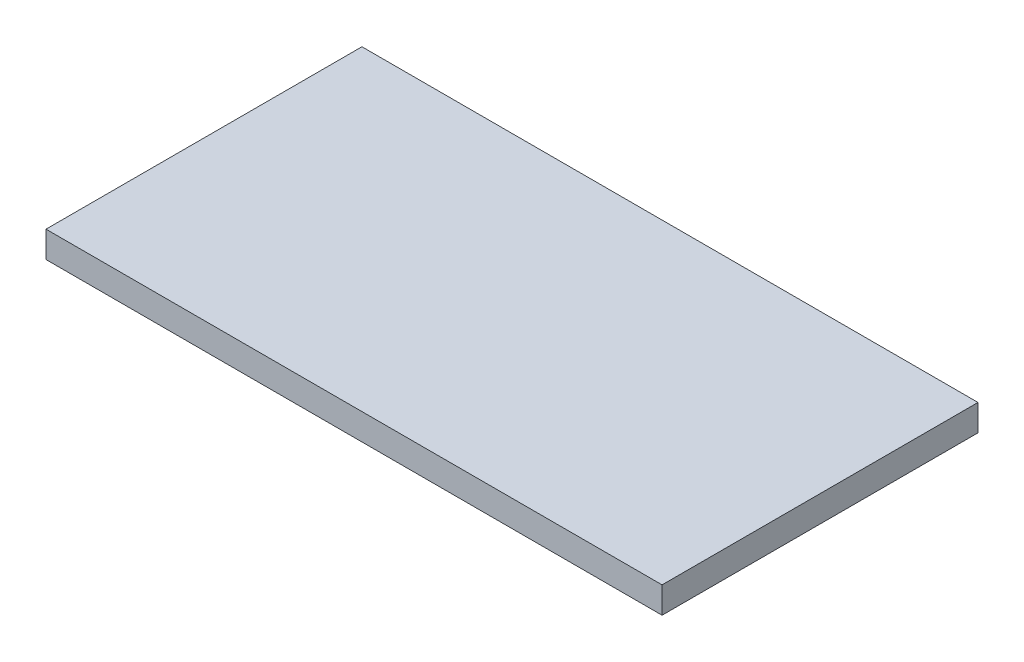
ISO-10303-21;
HEADER;
FILE_DESCRIPTION(('STEP AP214'),'2;1');
FILE_NAME('part.step','',(''),(''),'','','');
FILE_SCHEMA(('AUTOMOTIVE_DESIGN { 1 0 10303 214 1 1 1 1 }'));
ENDSEC;
DATA;
#1=APPLICATION_CONTEXT('core data for automotive mechanical design processes');
#2=APPLICATION_PROTOCOL_DEFINITION('international standard','automotive_design',2000,#1);
#3=PRODUCT_CONTEXT('',#1,'mechanical');
#4=PRODUCT('Part','Part','',(#3));
#5=PRODUCT_RELATED_PRODUCT_CATEGORY('part','',(#4));
#6=PRODUCT_DEFINITION_FORMATION('','',#4);
#7=PRODUCT_DEFINITION_CONTEXT('part definition',#1,'design');
#8=PRODUCT_DEFINITION('design','',#6,#7);
#9=PRODUCT_DEFINITION_SHAPE('','',#8);
#10=(LENGTH_UNIT() NAMED_UNIT(*) SI_UNIT(.MILLI.,.METRE.));
#11=(NAMED_UNIT(*) PLANE_ANGLE_UNIT() SI_UNIT($,.RADIAN.));
#12=(NAMED_UNIT(*) SI_UNIT($,.STERADIAN.) SOLID_ANGLE_UNIT());
#13=UNCERTAINTY_MEASURE_WITH_UNIT(LENGTH_MEASURE(1.E-05),#10,'distance_accuracy_value','');
#14=(GEOMETRIC_REPRESENTATION_CONTEXT(3) GLOBAL_UNCERTAINTY_ASSIGNED_CONTEXT((#13)) GLOBAL_UNIT_ASSIGNED_CONTEXT((#10,
#11,#12)) REPRESENTATION_CONTEXT('',''));
#15=CARTESIAN_POINT('',(0.,0.,0.));
#16=DIRECTION('',(0.,0.,1.));
#17=DIRECTION('',(1.,0.,0.));
#18=AXIS2_PLACEMENT_3D('',#15,#16,#17);
#19=CARTESIAN_POINT('',(0.,5.,30.));
#20=DIRECTION('',(0.,0.,-1.));
#21=DIRECTION('',(-1.,0.,0.));
#22=AXIS2_PLACEMENT_3D('',#19,#20,#21);
#23=PLANE('',#22);
#24=DIRECTION('',(1.,0.,0.));
#25=VECTOR('',#24,1.);
#26=CARTESIAN_POINT('',(0.,0.,30.));
#27=LINE('',#26,#25);
#28=CARTESIAN_POINT('',(-58.5,0.,30.));
#29=VERTEX_POINT('',#28);
#30=CARTESIAN_POINT('',(58.5,0.,30.));
#31=VERTEX_POINT('',#30);
#32=EDGE_CURVE('E98',#29,#31,#27,.T.);
#33=ORIENTED_EDGE('',*,*,#32,.T.);
#34=DIRECTION('',(0.,-1.,0.));
#35=VECTOR('',#34,1.);
#36=CARTESIAN_POINT('',(58.5,5.,30.));
#37=LINE('',#36,#35);
#38=CARTESIAN_POINT('',(58.5,5.,30.));
#39=VERTEX_POINT('',#38);
#40=EDGE_CURVE('E11',#39,#31,#37,.T.);
#41=ORIENTED_EDGE('',*,*,#40,.F.);
#42=DIRECTION('',(1.,0.,0.));
#43=VECTOR('',#42,1.);
#44=CARTESIAN_POINT('',(0.,5.,30.));
#45=LINE('',#44,#43);
#46=CARTESIAN_POINT('',(-58.5,5.,30.));
#47=VERTEX_POINT('',#46);
#48=EDGE_CURVE('E84',#47,#39,#45,.T.);
#49=ORIENTED_EDGE('',*,*,#48,.F.);
#50=DIRECTION('',(0.,-1.,0.));
#51=VECTOR('',#50,1.);
#52=CARTESIAN_POINT('',(-58.5,5.,30.));
#53=LINE('',#52,#51);
#54=EDGE_CURVE('E51',#47,#29,#53,.T.);
#55=ORIENTED_EDGE('',*,*,#54,.T.);
#56=EDGE_LOOP('',(#33,#41,#49,#55));
#57=FACE_BOUND('',#56,.T.);
#58=ADVANCED_FACE('F35',(#57),#23,.F.);
#59=CARTESIAN_POINT('',(58.5,5.,0.));
#60=DIRECTION('',(-1.,0.,0.));
#61=DIRECTION('',(0.,0.,1.));
#62=AXIS2_PLACEMENT_3D('',#59,#60,#61);
#63=PLANE('',#62);
#64=DIRECTION('',(0.,0.,-1.));
#65=VECTOR('',#64,1.);
#66=CARTESIAN_POINT('',(58.5,0.,0.));
#67=LINE('',#66,#65);
#68=CARTESIAN_POINT('',(58.5,0.,-30.));
#69=VERTEX_POINT('',#68);
#70=EDGE_CURVE('E89',#31,#69,#67,.T.);
#71=ORIENTED_EDGE('',*,*,#70,.T.);
#72=DIRECTION('',(0.,-1.,0.));
#73=VECTOR('',#72,1.);
#74=CARTESIAN_POINT('',(58.5,5.,-30.));
#75=LINE('',#74,#73);
#76=CARTESIAN_POINT('',(58.5,5.,-30.));
#77=VERTEX_POINT('',#76);
#78=EDGE_CURVE('E43',#77,#69,#75,.T.);
#79=ORIENTED_EDGE('',*,*,#78,.F.);
#80=DIRECTION('',(0.,0.,-1.));
#81=VECTOR('',#80,1.);
#82=CARTESIAN_POINT('',(58.5,5.,0.));
#83=LINE('',#82,#81);
#84=EDGE_CURVE('E76',#39,#77,#83,.T.);
#85=ORIENTED_EDGE('',*,*,#84,.F.);
#86=ORIENTED_EDGE('',*,*,#40,.T.);
#87=EDGE_LOOP('',(#71,#79,#85,#86));
#88=FACE_BOUND('',#87,.T.);
#89=ADVANCED_FACE('F88',(#88),#63,.F.);
#90=CARTESIAN_POINT('',(0.,5.,-30.));
#91=DIRECTION('',(0.,0.,-1.));
#92=DIRECTION('',(-1.,0.,0.));
#93=AXIS2_PLACEMENT_3D('',#90,#91,#92);
#94=PLANE('',#93);
#95=DIRECTION('',(1.,0.,0.));
#96=VECTOR('',#95,1.);
#97=CARTESIAN_POINT('',(0.,0.,-30.));
#98=LINE('',#97,#96);
#99=CARTESIAN_POINT('',(-58.5,0.,-30.));
#100=VERTEX_POINT('',#99);
#101=EDGE_CURVE('E101',#100,#69,#98,.T.);
#102=ORIENTED_EDGE('',*,*,#101,.F.);
#103=DIRECTION('',(0.,-1.,0.));
#104=VECTOR('',#103,1.);
#105=CARTESIAN_POINT('',(-58.5,5.,-30.));
#106=LINE('',#105,#104);
#107=CARTESIAN_POINT('',(-58.5,5.,-30.));
#108=VERTEX_POINT('',#107);
#109=EDGE_CURVE('E65',#108,#100,#106,.T.);
#110=ORIENTED_EDGE('',*,*,#109,.F.);
#111=DIRECTION('',(1.,0.,0.));
#112=VECTOR('',#111,1.);
#113=CARTESIAN_POINT('',(0.,5.,-30.));
#114=LINE('',#113,#112);
#115=EDGE_CURVE('E83',#108,#77,#114,.T.);
#116=ORIENTED_EDGE('',*,*,#115,.T.);
#117=ORIENTED_EDGE('',*,*,#78,.T.);
#118=EDGE_LOOP('',(#102,#110,#116,#117));
#119=FACE_BOUND('',#118,.T.);
#120=ADVANCED_FACE('F92',(#119),#94,.T.);
#121=CARTESIAN_POINT('',(-58.5,5.,0.));
#122=DIRECTION('',(-1.,0.,0.));
#123=DIRECTION('',(0.,0.,1.));
#124=AXIS2_PLACEMENT_3D('',#121,#122,#123);
#125=PLANE('',#124);
#126=DIRECTION('',(0.,0.,-1.));
#127=VECTOR('',#126,1.);
#128=CARTESIAN_POINT('',(-58.5,0.,0.));
#129=LINE('',#128,#127);
#130=EDGE_CURVE('E103',#29,#100,#129,.T.);
#131=ORIENTED_EDGE('',*,*,#130,.F.);
#132=ORIENTED_EDGE('',*,*,#54,.F.);
#133=DIRECTION('',(0.,0.,-1.));
#134=VECTOR('',#133,1.);
#135=CARTESIAN_POINT('',(-58.5,5.,0.));
#136=LINE('',#135,#134);
#137=EDGE_CURVE('E93',#47,#108,#136,.T.);
#138=ORIENTED_EDGE('',*,*,#137,.T.);
#139=ORIENTED_EDGE('',*,*,#109,.T.);
#140=EDGE_LOOP('',(#131,#132,#138,#139));
#141=FACE_BOUND('',#140,.T.);
#142=ADVANCED_FACE('F109',(#141),#125,.T.);
#143=CARTESIAN_POINT('',(0.,5.,0.));
#144=DIRECTION('',(0.,1.,0.));
#145=DIRECTION('',(0.,0.,1.));
#146=AXIS2_PLACEMENT_3D('',#143,#144,#145);
#147=PLANE('',#146);
#148=ORIENTED_EDGE('',*,*,#48,.T.);
#149=ORIENTED_EDGE('',*,*,#84,.T.);
#150=ORIENTED_EDGE('',*,*,#115,.F.);
#151=ORIENTED_EDGE('',*,*,#137,.F.);
#152=EDGE_LOOP('',(#148,#149,#150,#151));
#153=FACE_BOUND('',#152,.T.);
#154=ADVANCED_FACE('F80',(#153),#147,.T.);
#155=CARTESIAN_POINT('',(0.,0.,0.));
#156=DIRECTION('',(0.,1.,0.));
#157=DIRECTION('',(0.,0.,1.));
#158=AXIS2_PLACEMENT_3D('',#155,#156,#157);
#159=PLANE('',#158);
#160=ORIENTED_EDGE('',*,*,#32,.F.);
#161=ORIENTED_EDGE('',*,*,#130,.T.);
#162=ORIENTED_EDGE('',*,*,#101,.T.);
#163=ORIENTED_EDGE('',*,*,#70,.F.);
#164=EDGE_LOOP('',(#160,#161,#162,#163));
#165=FACE_BOUND('',#164,.T.);
#166=ADVANCED_FACE('F108',(#165),#159,.F.);
#167=CLOSED_SHELL('',(#58,#89,#120,#142,#154,#166));
#168=MANIFOLD_SOLID_BREP('B2',#167);
#169=ADVANCED_BREP_SHAPE_REPRESENTATION('',(#18,#168),#14);
#170=SHAPE_DEFINITION_REPRESENTATION(#9,#169);
ENDSEC;
END-ISO-10303-21;
